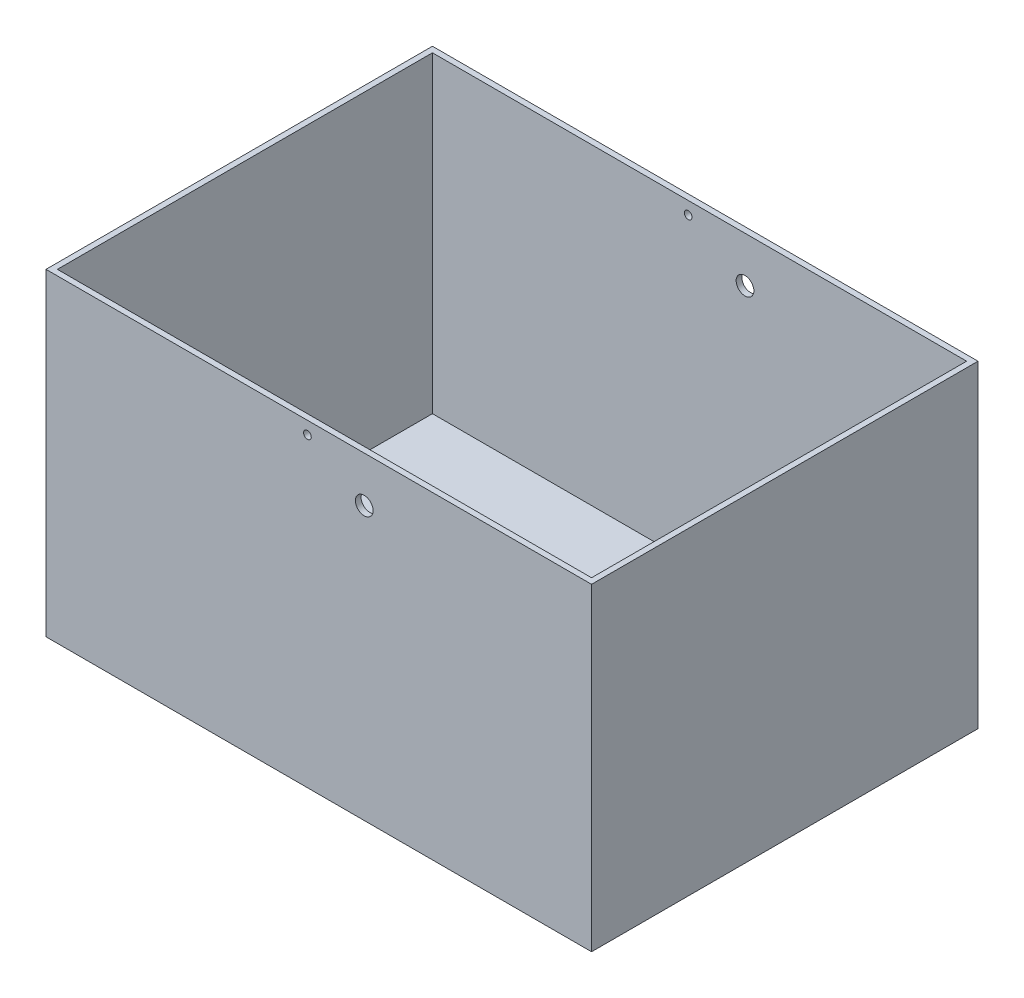
ISO-10303-21;
HEADER;
FILE_DESCRIPTION(('STEP AP214'),'2;1');
FILE_NAME('part.step','',(''),(''),'','','');
FILE_SCHEMA(('AUTOMOTIVE_DESIGN { 1 0 10303 214 1 1 1 1 }'));
ENDSEC;
DATA;
#1=APPLICATION_CONTEXT('core data for automotive mechanical design processes');
#2=APPLICATION_PROTOCOL_DEFINITION('international standard','automotive_design',2000,#1);
#3=PRODUCT_CONTEXT('',#1,'mechanical');
#4=PRODUCT('Part','Part','',(#3));
#5=PRODUCT_RELATED_PRODUCT_CATEGORY('part','',(#4));
#6=PRODUCT_DEFINITION_FORMATION('','',#4);
#7=PRODUCT_DEFINITION_CONTEXT('part definition',#1,'design');
#8=PRODUCT_DEFINITION('design','',#6,#7);
#9=PRODUCT_DEFINITION_SHAPE('','',#8);
#10=(LENGTH_UNIT() NAMED_UNIT(*) SI_UNIT(.MILLI.,.METRE.));
#11=(NAMED_UNIT(*) PLANE_ANGLE_UNIT() SI_UNIT($,.RADIAN.));
#12=(NAMED_UNIT(*) SI_UNIT($,.STERADIAN.) SOLID_ANGLE_UNIT());
#13=UNCERTAINTY_MEASURE_WITH_UNIT(LENGTH_MEASURE(1.E-05),#10,'distance_accuracy_value','');
#14=(GEOMETRIC_REPRESENTATION_CONTEXT(3) GLOBAL_UNCERTAINTY_ASSIGNED_CONTEXT((#13)) GLOBAL_UNIT_ASSIGNED_CONTEXT((#10,
#11,#12)) REPRESENTATION_CONTEXT('',''));
#15=CARTESIAN_POINT('',(0.,0.,0.));
#16=DIRECTION('',(0.,0.,1.));
#17=DIRECTION('',(1.,0.,0.));
#18=AXIS2_PLACEMENT_3D('',#15,#16,#17);
#19=CARTESIAN_POINT('',(0.,3.175,0.));
#20=DIRECTION('',(0.,1.,0.));
#21=DIRECTION('',(0.,0.,1.));
#22=AXIS2_PLACEMENT_3D('',#19,#20,#21);
#23=PLANE('',#22);
#24=DIRECTION('',(1.,0.,0.));
#25=VECTOR('',#24,1.);
#26=CARTESIAN_POINT('',(0.,3.175,104.775));
#27=LINE('',#26,#25);
#28=CARTESIAN_POINT('',(-149.225,3.17500000000001,104.775));
#29=VERTEX_POINT('',#28);
#30=CARTESIAN_POINT('',(149.225,3.175,104.775));
#31=VERTEX_POINT('',#30);
#32=EDGE_CURVE('E166',#29,#31,#27,.T.);
#33=ORIENTED_EDGE('',*,*,#32,.T.);
#34=DIRECTION('',(0.,0.,-1.));
#35=VECTOR('',#34,1.);
#36=CARTESIAN_POINT('',(149.225,3.175,0.));
#37=LINE('',#36,#35);
#38=CARTESIAN_POINT('',(149.225,3.17500000000001,-104.775));
#39=VERTEX_POINT('',#38);
#40=EDGE_CURVE('E169',#31,#39,#37,.T.);
#41=ORIENTED_EDGE('',*,*,#40,.T.);
#42=DIRECTION('',(1.,0.,0.));
#43=VECTOR('',#42,1.);
#44=CARTESIAN_POINT('',(0.,3.175,-104.775));
#45=LINE('',#44,#43);
#46=CARTESIAN_POINT('',(-149.225,3.17500000000001,-104.775));
#47=VERTEX_POINT('',#46);
#48=EDGE_CURVE('E50',#47,#39,#45,.T.);
#49=ORIENTED_EDGE('',*,*,#48,.F.);
#50=DIRECTION('',(0.,0.,-1.));
#51=VECTOR('',#50,1.);
#52=CARTESIAN_POINT('',(-149.225,3.175,0.));
#53=LINE('',#52,#51);
#54=EDGE_CURVE('E11',#29,#47,#53,.T.);
#55=ORIENTED_EDGE('',*,*,#54,.F.);
#56=EDGE_LOOP('',(#33,#41,#49,#55));
#57=FACE_BOUND('',#56,.T.);
#58=ADVANCED_FACE('F41',(#57),#23,.T.);
#59=CARTESIAN_POINT('',(0.,177.8,0.));
#60=DIRECTION('',(0.,1.,0.));
#61=DIRECTION('',(0.,0.,1.));
#62=AXIS2_PLACEMENT_3D('',#59,#60,#61);
#63=PLANE('',#62);
#64=DIRECTION('',(0.,0.,-1.));
#65=VECTOR('',#64,1.);
#66=CARTESIAN_POINT('',(152.4,177.8,-107.95));
#67=LINE('',#66,#65);
#68=CARTESIAN_POINT('',(152.4,177.8,107.95));
#69=VERTEX_POINT('',#68);
#70=CARTESIAN_POINT('',(152.4,177.8,-107.95));
#71=VERTEX_POINT('',#70);
#72=EDGE_CURVE('E137',#69,#71,#67,.T.);
#73=ORIENTED_EDGE('',*,*,#72,.T.);
#74=DIRECTION('',(-1.,0.,0.));
#75=VECTOR('',#74,1.);
#76=CARTESIAN_POINT('',(-152.4,177.8,-107.95));
#77=LINE('',#76,#75);
#78=CARTESIAN_POINT('',(-152.4,177.8,-107.95));
#79=VERTEX_POINT('',#78);
#80=EDGE_CURVE('E140',#71,#79,#77,.T.);
#81=ORIENTED_EDGE('',*,*,#80,.T.);
#82=DIRECTION('',(0.,0.,1.));
#83=VECTOR('',#82,1.);
#84=CARTESIAN_POINT('',(-152.4,177.8,-107.95));
#85=LINE('',#84,#83);
#86=CARTESIAN_POINT('',(-152.4,177.8,107.95));
#87=VERTEX_POINT('',#86);
#88=EDGE_CURVE('E143',#79,#87,#85,.T.);
#89=ORIENTED_EDGE('',*,*,#88,.T.);
#90=DIRECTION('',(1.,0.,0.));
#91=VECTOR('',#90,1.);
#92=CARTESIAN_POINT('',(-152.4,177.8,107.95));
#93=LINE('',#92,#91);
#94=EDGE_CURVE('E145',#87,#69,#93,.T.);
#95=ORIENTED_EDGE('',*,*,#94,.T.);
#96=EDGE_LOOP('',(#73,#81,#89,#95));
#97=FACE_BOUND('',#96,.T.);
#98=DIRECTION('',(-1.,0.,0.));
#99=VECTOR('',#98,1.);
#100=CARTESIAN_POINT('',(-149.225,177.8,-104.775));
#101=LINE('',#100,#99);
#102=CARTESIAN_POINT('',(149.225,177.8,-104.775));
#103=VERTEX_POINT('',#102);
#104=CARTESIAN_POINT('',(-149.225,177.8,-104.775));
#105=VERTEX_POINT('',#104);
#106=EDGE_CURVE('E114',#103,#105,#101,.T.);
#107=ORIENTED_EDGE('',*,*,#106,.F.);
#108=DIRECTION('',(0.,0.,-1.));
#109=VECTOR('',#108,1.);
#110=CARTESIAN_POINT('',(149.225,177.8,104.775));
#111=LINE('',#110,#109);
#112=CARTESIAN_POINT('',(149.225,177.8,104.775));
#113=VERTEX_POINT('',#112);
#114=EDGE_CURVE('E107',#113,#103,#111,.T.);
#115=ORIENTED_EDGE('',*,*,#114,.F.);
#116=DIRECTION('',(1.,0.,0.));
#117=VECTOR('',#116,1.);
#118=CARTESIAN_POINT('',(-149.225,177.8,104.775));
#119=LINE('',#118,#117);
#120=CARTESIAN_POINT('',(-149.225,177.8,104.775));
#121=VERTEX_POINT('',#120);
#122=EDGE_CURVE('E127',#121,#113,#119,.T.);
#123=ORIENTED_EDGE('',*,*,#122,.F.);
#124=DIRECTION('',(0.,0.,1.));
#125=VECTOR('',#124,1.);
#126=CARTESIAN_POINT('',(-149.225,177.8,104.775));
#127=LINE('',#126,#125);
#128=EDGE_CURVE('E125',#105,#121,#127,.T.);
#129=ORIENTED_EDGE('',*,*,#128,.F.);
#130=EDGE_LOOP('',(#107,#115,#123,#129));
#131=FACE_BOUND('',#130,.T.);
#132=ADVANCED_FACE('F123',(#97,#131),#63,.T.);
#133=CARTESIAN_POINT('',(152.4,177.8,-107.95));
#134=DIRECTION('',(-1.,0.,0.));
#135=DIRECTION('',(0.,0.,1.));
#136=AXIS2_PLACEMENT_3D('',#133,#134,#135);
#137=PLANE('',#136);
#138=DIRECTION('',(0.,0.,-1.));
#139=VECTOR('',#138,1.);
#140=CARTESIAN_POINT('',(152.4,0.,-107.95));
#141=LINE('',#140,#139);
#142=CARTESIAN_POINT('',(152.4,0.,107.95));
#143=VERTEX_POINT('',#142);
#144=CARTESIAN_POINT('',(152.4,0.,-107.95));
#145=VERTEX_POINT('',#144);
#146=EDGE_CURVE('E119',#143,#145,#141,.T.);
#147=ORIENTED_EDGE('',*,*,#146,.T.);
#148=DIRECTION('',(0.,-1.,0.));
#149=VECTOR('',#148,1.);
#150=CARTESIAN_POINT('',(152.4,177.8,-107.95));
#151=LINE('',#150,#149);
#152=EDGE_CURVE('E163',#71,#145,#151,.T.);
#153=ORIENTED_EDGE('',*,*,#152,.F.);
#154=ORIENTED_EDGE('',*,*,#72,.F.);
#155=DIRECTION('',(0.,-1.,0.));
#156=VECTOR('',#155,1.);
#157=CARTESIAN_POINT('',(152.4,177.8,107.95));
#158=LINE('',#157,#156);
#159=EDGE_CURVE('E147',#69,#143,#158,.T.);
#160=ORIENTED_EDGE('',*,*,#159,.T.);
#161=EDGE_LOOP('',(#147,#153,#154,#160));
#162=FACE_BOUND('',#161,.T.);
#163=ADVANCED_FACE('F219',(#162),#137,.F.);
#164=CARTESIAN_POINT('',(-152.4,177.8,-107.95));
#165=DIRECTION('',(0.,0.,1.));
#166=DIRECTION('',(1.,0.,0.));
#167=AXIS2_PLACEMENT_3D('',#164,#165,#166);
#168=PLANE('',#167);
#169=CARTESIAN_POINT('',(25.4,152.4,-107.95));
#170=DIRECTION('',(0.,0.,1.));
#171=DIRECTION('',(1.,0.,0.));
#172=AXIS2_PLACEMENT_3D('',#169,#170,#171);
#173=CIRCLE('',#172,4.953);
#174=CARTESIAN_POINT('',(30.353,152.4,-107.95));
#175=VERTEX_POINT('',#174);
#176=EDGE_CURVE('E174',#175,#175,#173,.T.);
#177=ORIENTED_EDGE('',*,*,#176,.T.);
#178=EDGE_LOOP('',(#177));
#179=FACE_BOUND('',#178,.T.);
#180=CARTESIAN_POINT('',(-6.35000000000002,170.7322,-107.95));
#181=DIRECTION('',(0.,0.,1.));
#182=DIRECTION('',(1.,0.,0.));
#183=AXIS2_PLACEMENT_3D('',#180,#181,#182);
#184=CIRCLE('',#183,2.15000000000001);
#185=CARTESIAN_POINT('',(-4.20000000000001,170.7322,-107.95));
#186=VERTEX_POINT('',#185);
#187=EDGE_CURVE('E181',#186,#186,#184,.T.);
#188=ORIENTED_EDGE('',*,*,#187,.T.);
#189=EDGE_LOOP('',(#188));
#190=FACE_BOUND('',#189,.T.);
#191=DIRECTION('',(-1.,0.,0.));
#192=VECTOR('',#191,1.);
#193=CARTESIAN_POINT('',(-152.4,0.,-107.95));
#194=LINE('',#193,#192);
#195=CARTESIAN_POINT('',(-152.4,0.,-107.95));
#196=VERTEX_POINT('',#195);
#197=EDGE_CURVE('E150',#145,#196,#194,.T.);
#198=ORIENTED_EDGE('',*,*,#197,.T.);
#199=DIRECTION('',(0.,-1.,0.));
#200=VECTOR('',#199,1.);
#201=CARTESIAN_POINT('',(-152.4,177.8,-107.95));
#202=LINE('',#201,#200);
#203=EDGE_CURVE('E160',#79,#196,#202,.T.);
#204=ORIENTED_EDGE('',*,*,#203,.F.);
#205=ORIENTED_EDGE('',*,*,#80,.F.);
#206=ORIENTED_EDGE('',*,*,#152,.T.);
#207=EDGE_LOOP('',(#198,#204,#205,#206));
#208=FACE_BOUND('',#207,.T.);
#209=ADVANCED_FACE('F225',(#179,#190,#208),#168,.F.);
#210=CARTESIAN_POINT('',(-152.4,177.8,-107.95));
#211=DIRECTION('',(1.,0.,0.));
#212=DIRECTION('',(0.,0.,-1.));
#213=AXIS2_PLACEMENT_3D('',#210,#211,#212);
#214=PLANE('',#213);
#215=DIRECTION('',(0.,0.,1.));
#216=VECTOR('',#215,1.);
#217=CARTESIAN_POINT('',(-152.4,0.,-107.95));
#218=LINE('',#217,#216);
#219=CARTESIAN_POINT('',(-152.4,0.,107.95));
#220=VERTEX_POINT('',#219);
#221=EDGE_CURVE('E152',#196,#220,#218,.T.);
#222=ORIENTED_EDGE('',*,*,#221,.T.);
#223=DIRECTION('',(0.,-1.,0.));
#224=VECTOR('',#223,1.);
#225=CARTESIAN_POINT('',(-152.4,177.8,107.95));
#226=LINE('',#225,#224);
#227=EDGE_CURVE('E157',#87,#220,#226,.T.);
#228=ORIENTED_EDGE('',*,*,#227,.F.);
#229=ORIENTED_EDGE('',*,*,#88,.F.);
#230=ORIENTED_EDGE('',*,*,#203,.T.);
#231=EDGE_LOOP('',(#222,#228,#229,#230));
#232=FACE_BOUND('',#231,.T.);
#233=ADVANCED_FACE('F229',(#232),#214,.F.);
#234=CARTESIAN_POINT('',(-152.4,177.8,107.95));
#235=DIRECTION('',(0.,0.,-1.));
#236=DIRECTION('',(-1.,0.,0.));
#237=AXIS2_PLACEMENT_3D('',#234,#235,#236);
#238=PLANE('',#237);
#239=CARTESIAN_POINT('',(25.4,152.4,107.95));
#240=DIRECTION('',(0.,0.,-1.));
#241=DIRECTION('',(-1.,0.,0.));
#242=AXIS2_PLACEMENT_3D('',#239,#240,#241);
#243=CIRCLE('',#242,4.953);
#244=CARTESIAN_POINT('',(20.447,152.4,107.95));
#245=VERTEX_POINT('',#244);
#246=EDGE_CURVE('E115',#245,#245,#243,.T.);
#247=ORIENTED_EDGE('',*,*,#246,.T.);
#248=EDGE_LOOP('',(#247));
#249=FACE_BOUND('',#248,.T.);
#250=CARTESIAN_POINT('',(-6.35000000000002,170.7322,107.95));
#251=DIRECTION('',(0.,0.,-1.));
#252=DIRECTION('',(-1.,0.,0.));
#253=AXIS2_PLACEMENT_3D('',#250,#251,#252);
#254=CIRCLE('',#253,2.15000000000001);
#255=CARTESIAN_POINT('',(-8.50000000000004,170.7322,107.95));
#256=VERTEX_POINT('',#255);
#257=EDGE_CURVE('E178',#256,#256,#254,.T.);
#258=ORIENTED_EDGE('',*,*,#257,.T.);
#259=EDGE_LOOP('',(#258));
#260=FACE_BOUND('',#259,.T.);
#261=DIRECTION('',(1.,0.,0.));
#262=VECTOR('',#261,1.);
#263=CARTESIAN_POINT('',(-152.4,0.,107.95));
#264=LINE('',#263,#262);
#265=EDGE_CURVE('E141',#220,#143,#264,.T.);
#266=ORIENTED_EDGE('',*,*,#265,.T.);
#267=ORIENTED_EDGE('',*,*,#159,.F.);
#268=ORIENTED_EDGE('',*,*,#94,.F.);
#269=ORIENTED_EDGE('',*,*,#227,.T.);
#270=EDGE_LOOP('',(#266,#267,#268,#269));
#271=FACE_BOUND('',#270,.T.);
#272=ADVANCED_FACE('F195',(#249,#260,#271),#238,.F.);
#273=CARTESIAN_POINT('',(149.225,177.8,104.775));
#274=DIRECTION('',(-1.,0.,0.));
#275=DIRECTION('',(0.,0.,1.));
#276=AXIS2_PLACEMENT_3D('',#273,#274,#275);
#277=PLANE('',#276);
#278=DIRECTION('',(0.,-1.,0.));
#279=VECTOR('',#278,1.);
#280=CARTESIAN_POINT('',(149.225,177.8,-104.775));
#281=LINE('',#280,#279);
#282=EDGE_CURVE('E109',#103,#39,#281,.T.);
#283=ORIENTED_EDGE('',*,*,#282,.T.);
#284=ORIENTED_EDGE('',*,*,#40,.F.);
#285=DIRECTION('',(0.,-1.,0.));
#286=VECTOR('',#285,1.);
#287=CARTESIAN_POINT('',(149.225,177.8,104.775));
#288=LINE('',#287,#286);
#289=EDGE_CURVE('E58',#113,#31,#288,.T.);
#290=ORIENTED_EDGE('',*,*,#289,.F.);
#291=ORIENTED_EDGE('',*,*,#114,.T.);
#292=EDGE_LOOP('',(#283,#284,#290,#291));
#293=FACE_BOUND('',#292,.T.);
#294=ADVANCED_FACE('F108',(#293),#277,.T.);
#295=CARTESIAN_POINT('',(-149.225,177.8,-104.775));
#296=DIRECTION('',(0.,0.,1.));
#297=DIRECTION('',(1.,0.,0.));
#298=AXIS2_PLACEMENT_3D('',#295,#296,#297);
#299=PLANE('',#298);
#300=CARTESIAN_POINT('',(25.4,152.4,-104.775));
#301=DIRECTION('',(0.,0.,1.));
#302=DIRECTION('',(1.,0.,0.));
#303=AXIS2_PLACEMENT_3D('',#300,#301,#302);
#304=CIRCLE('',#303,4.953);
#305=CARTESIAN_POINT('',(30.353,152.4,-104.775));
#306=VERTEX_POINT('',#305);
#307=EDGE_CURVE('E190',#306,#306,#304,.T.);
#308=ORIENTED_EDGE('',*,*,#307,.F.);
#309=EDGE_LOOP('',(#308));
#310=FACE_BOUND('',#309,.T.);
#311=CARTESIAN_POINT('',(-6.35000000000002,170.7322,-104.775));
#312=DIRECTION('',(0.,0.,1.));
#313=DIRECTION('',(1.,0.,0.));
#314=AXIS2_PLACEMENT_3D('',#311,#312,#313);
#315=CIRCLE('',#314,2.15000000000001);
#316=CARTESIAN_POINT('',(-4.20000000000001,170.7322,-104.775));
#317=VERTEX_POINT('',#316);
#318=EDGE_CURVE('E173',#317,#317,#315,.T.);
#319=ORIENTED_EDGE('',*,*,#318,.F.);
#320=EDGE_LOOP('',(#319));
#321=FACE_BOUND('',#320,.T.);
#322=DIRECTION('',(0.,-1.,0.));
#323=VECTOR('',#322,1.);
#324=CARTESIAN_POINT('',(-149.225,177.8,-104.775));
#325=LINE('',#324,#323);
#326=EDGE_CURVE('E120',#105,#47,#325,.T.);
#327=ORIENTED_EDGE('',*,*,#326,.T.);
#328=ORIENTED_EDGE('',*,*,#48,.T.);
#329=ORIENTED_EDGE('',*,*,#282,.F.);
#330=ORIENTED_EDGE('',*,*,#106,.T.);
#331=EDGE_LOOP('',(#327,#328,#329,#330));
#332=FACE_BOUND('',#331,.T.);
#333=ADVANCED_FACE('F117',(#310,#321,#332),#299,.T.);
#334=CARTESIAN_POINT('',(-149.225,177.8,104.775));
#335=DIRECTION('',(1.,0.,0.));
#336=DIRECTION('',(0.,0.,-1.));
#337=AXIS2_PLACEMENT_3D('',#334,#335,#336);
#338=PLANE('',#337);
#339=DIRECTION('',(0.,-1.,0.));
#340=VECTOR('',#339,1.);
#341=CARTESIAN_POINT('',(-149.225,177.8,104.775));
#342=LINE('',#341,#340);
#343=EDGE_CURVE('E133',#121,#29,#342,.T.);
#344=ORIENTED_EDGE('',*,*,#343,.T.);
#345=ORIENTED_EDGE('',*,*,#54,.T.);
#346=ORIENTED_EDGE('',*,*,#326,.F.);
#347=ORIENTED_EDGE('',*,*,#128,.T.);
#348=EDGE_LOOP('',(#344,#345,#346,#347));
#349=FACE_BOUND('',#348,.T.);
#350=ADVANCED_FACE('F239',(#349),#338,.T.);
#351=CARTESIAN_POINT('',(-149.225,177.8,104.775));
#352=DIRECTION('',(0.,0.,-1.));
#353=DIRECTION('',(-1.,0.,0.));
#354=AXIS2_PLACEMENT_3D('',#351,#352,#353);
#355=PLANE('',#354);
#356=CARTESIAN_POINT('',(25.4,152.4,104.775));
#357=DIRECTION('',(0.,0.,-1.));
#358=DIRECTION('',(-1.,0.,0.));
#359=AXIS2_PLACEMENT_3D('',#356,#357,#358);
#360=CIRCLE('',#359,4.953);
#361=CARTESIAN_POINT('',(20.447,152.4,104.775));
#362=VERTEX_POINT('',#361);
#363=EDGE_CURVE('E45',#362,#362,#360,.T.);
#364=ORIENTED_EDGE('',*,*,#363,.F.);
#365=EDGE_LOOP('',(#364));
#366=FACE_BOUND('',#365,.T.);
#367=CARTESIAN_POINT('',(-6.35000000000002,170.7322,104.775));
#368=DIRECTION('',(0.,0.,-1.));
#369=DIRECTION('',(-1.,0.,0.));
#370=AXIS2_PLACEMENT_3D('',#367,#368,#369);
#371=CIRCLE('',#370,2.15000000000001);
#372=CARTESIAN_POINT('',(-8.50000000000004,170.7322,104.775));
#373=VERTEX_POINT('',#372);
#374=EDGE_CURVE('E171',#373,#373,#371,.T.);
#375=ORIENTED_EDGE('',*,*,#374,.F.);
#376=EDGE_LOOP('',(#375));
#377=FACE_BOUND('',#376,.T.);
#378=ORIENTED_EDGE('',*,*,#289,.T.);
#379=ORIENTED_EDGE('',*,*,#32,.F.);
#380=ORIENTED_EDGE('',*,*,#343,.F.);
#381=ORIENTED_EDGE('',*,*,#122,.T.);
#382=EDGE_LOOP('',(#378,#379,#380,#381));
#383=FACE_BOUND('',#382,.T.);
#384=ADVANCED_FACE('F243',(#366,#377,#383),#355,.T.);
#385=CARTESIAN_POINT('',(0.,0.,0.));
#386=DIRECTION('',(0.,1.,0.));
#387=DIRECTION('',(0.,0.,1.));
#388=AXIS2_PLACEMENT_3D('',#385,#386,#387);
#389=PLANE('',#388);
#390=ORIENTED_EDGE('',*,*,#146,.F.);
#391=ORIENTED_EDGE('',*,*,#265,.F.);
#392=ORIENTED_EDGE('',*,*,#221,.F.);
#393=ORIENTED_EDGE('',*,*,#197,.F.);
#394=EDGE_LOOP('',(#390,#391,#392,#393));
#395=FACE_BOUND('',#394,.T.);
#396=ADVANCED_FACE('F43',(#395),#389,.F.);
#397=CARTESIAN_POINT('',(-6.35000000000002,170.7322,-107.95));
#398=DIRECTION('',(0.,0.,1.));
#399=DIRECTION('',(1.,0.,0.));
#400=AXIS2_PLACEMENT_3D('',#397,#398,#399);
#401=CYLINDRICAL_SURFACE('',#400,2.15000000000001);
#402=ORIENTED_EDGE('',*,*,#374,.T.);
#403=EDGE_LOOP('',(#402));
#404=FACE_BOUND('',#403,.T.);
#405=ORIENTED_EDGE('',*,*,#257,.F.);
#406=EDGE_LOOP('',(#405));
#407=FACE_BOUND('',#406,.T.);
#408=ADVANCED_FACE('F201',(#404,#407),#401,.F.);
#409=CARTESIAN_POINT('',(25.4,152.4,-107.95));
#410=DIRECTION('',(0.,0.,1.));
#411=DIRECTION('',(1.,0.,0.));
#412=AXIS2_PLACEMENT_3D('',#409,#410,#411);
#413=CYLINDRICAL_SURFACE('',#412,4.953);
#414=ORIENTED_EDGE('',*,*,#363,.T.);
#415=EDGE_LOOP('',(#414));
#416=FACE_BOUND('',#415,.T.);
#417=ORIENTED_EDGE('',*,*,#246,.F.);
#418=EDGE_LOOP('',(#417));
#419=FACE_BOUND('',#418,.T.);
#420=ADVANCED_FACE('F198',(#416,#419),#413,.F.);
#421=ORIENTED_EDGE('',*,*,#318,.T.);
#422=EDGE_LOOP('',(#421));
#423=FACE_BOUND('',#422,.T.);
#424=ORIENTED_EDGE('',*,*,#187,.F.);
#425=EDGE_LOOP('',(#424));
#426=FACE_BOUND('',#425,.T.);
#427=ADVANCED_FACE('F200',(#423,#426),#401,.F.);
#428=ORIENTED_EDGE('',*,*,#307,.T.);
#429=EDGE_LOOP('',(#428));
#430=FACE_BOUND('',#429,.T.);
#431=ORIENTED_EDGE('',*,*,#176,.F.);
#432=EDGE_LOOP('',(#431));
#433=FACE_BOUND('',#432,.T.);
#434=ADVANCED_FACE('F204',(#430,#433),#413,.F.);
#435=CLOSED_SHELL('',(#58,#132,#163,#209,#233,#272,#294,#333,#350,#384,#396,#408,#420,#427,#434));
#436=MANIFOLD_SOLID_BREP('B2',#435);
#437=ADVANCED_BREP_SHAPE_REPRESENTATION('',(#18,#436),#14);
#438=SHAPE_DEFINITION_REPRESENTATION(#9,#437);
ENDSEC;
END-ISO-10303-21;
